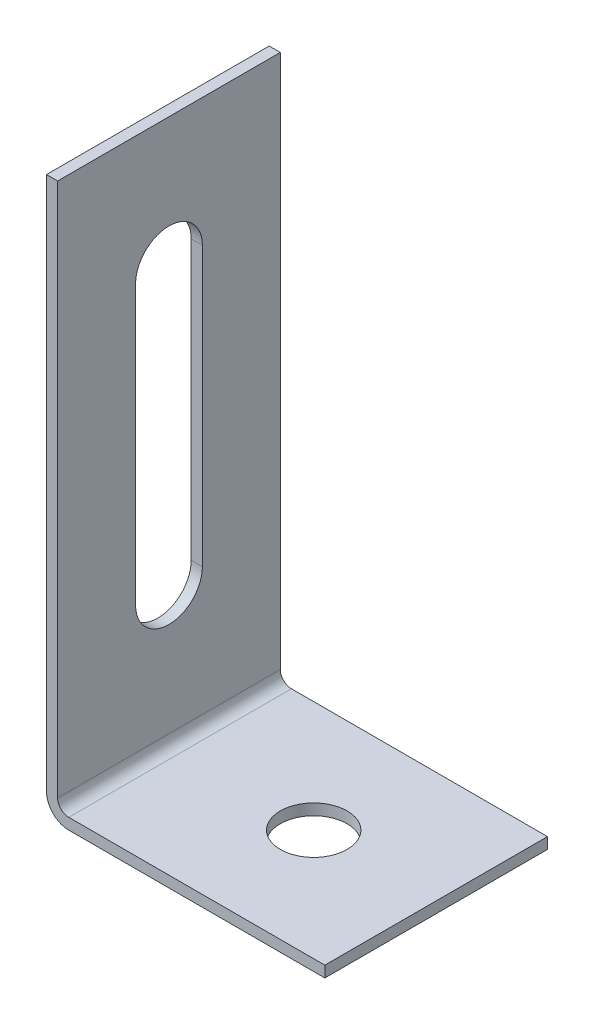
ISO-10303-21;
HEADER;
FILE_DESCRIPTION(('STEP AP214'),'2;1');
FILE_NAME('part.step','',(''),(''),'','','');
FILE_SCHEMA(('AUTOMOTIVE_DESIGN { 1 0 10303 214 1 1 1 1 }'));
ENDSEC;
DATA;
#1=APPLICATION_CONTEXT('core data for automotive mechanical design processes');
#2=APPLICATION_PROTOCOL_DEFINITION('international standard','automotive_design',2000,#1);
#3=PRODUCT_CONTEXT('',#1,'mechanical');
#4=PRODUCT('Part','Part','',(#3));
#5=PRODUCT_RELATED_PRODUCT_CATEGORY('part','',(#4));
#6=PRODUCT_DEFINITION_FORMATION('','',#4);
#7=PRODUCT_DEFINITION_CONTEXT('part definition',#1,'design');
#8=PRODUCT_DEFINITION('design','',#6,#7);
#9=PRODUCT_DEFINITION_SHAPE('','',#8);
#10=(LENGTH_UNIT() NAMED_UNIT(*) SI_UNIT(.MILLI.,.METRE.));
#11=(NAMED_UNIT(*) PLANE_ANGLE_UNIT() SI_UNIT($,.RADIAN.));
#12=(NAMED_UNIT(*) SI_UNIT($,.STERADIAN.) SOLID_ANGLE_UNIT());
#13=UNCERTAINTY_MEASURE_WITH_UNIT(LENGTH_MEASURE(1.E-05),#10,'distance_accuracy_value','');
#14=(GEOMETRIC_REPRESENTATION_CONTEXT(3) GLOBAL_UNCERTAINTY_ASSIGNED_CONTEXT((#13)) GLOBAL_UNIT_ASSIGNED_CONTEXT((#10,
#11,#12)) REPRESENTATION_CONTEXT('',''));
#15=CARTESIAN_POINT('',(0.,0.,0.));
#16=DIRECTION('',(0.,0.,1.));
#17=DIRECTION('',(1.,0.,0.));
#18=AXIS2_PLACEMENT_3D('',#15,#16,#17);
#19=CARTESIAN_POINT('',(0.,50.,20.));
#20=DIRECTION('',(0.,-1.,0.));
#21=DIRECTION('',(0.,0.,-1.));
#22=AXIS2_PLACEMENT_3D('',#19,#20,#21);
#23=PLANE('',#22);
#24=DIRECTION('',(-1.,0.,0.));
#25=VECTOR('',#24,1.);
#26=CARTESIAN_POINT('',(0.,50.,0.));
#27=LINE('',#26,#25);
#28=CARTESIAN_POINT('',(1.00000000000001,50.,0.));
#29=VERTEX_POINT('',#28);
#30=CARTESIAN_POINT('',(0.,50.,0.));
#31=VERTEX_POINT('',#30);
#32=EDGE_CURVE('E166',#29,#31,#27,.T.);
#33=ORIENTED_EDGE('',*,*,#32,.T.);
#34=DIRECTION('',(0.,0.,-1.));
#35=VECTOR('',#34,1.);
#36=CARTESIAN_POINT('',(0.,50.,20.));
#37=LINE('',#36,#35);
#38=CARTESIAN_POINT('',(0.,50.,20.));
#39=VERTEX_POINT('',#38);
#40=EDGE_CURVE('E11',#39,#31,#37,.T.);
#41=ORIENTED_EDGE('',*,*,#40,.F.);
#42=DIRECTION('',(-1.,0.,0.));
#43=VECTOR('',#42,1.);
#44=CARTESIAN_POINT('',(0.,50.,20.));
#45=LINE('',#44,#43);
#46=CARTESIAN_POINT('',(1.00000000000001,50.,20.));
#47=VERTEX_POINT('',#46);
#48=EDGE_CURVE('E167',#47,#39,#45,.T.);
#49=ORIENTED_EDGE('',*,*,#48,.F.);
#50=DIRECTION('',(0.,0.,-1.));
#51=VECTOR('',#50,1.);
#52=CARTESIAN_POINT('',(1.00000000000001,50.,20.));
#53=LINE('',#52,#51);
#54=EDGE_CURVE('E185',#47,#29,#53,.T.);
#55=ORIENTED_EDGE('',*,*,#54,.T.);
#56=EDGE_LOOP('',(#33,#41,#49,#55));
#57=FACE_BOUND('',#56,.T.);
#58=ADVANCED_FACE('F41',(#57),#23,.F.);
#59=CARTESIAN_POINT('',(0.,2.00000000000001,20.));
#60=DIRECTION('',(1.,0.,0.));
#61=DIRECTION('',(0.,1.,0.));
#62=AXIS2_PLACEMENT_3D('',#59,#60,#61);
#63=PLANE('',#62);
#64=DIRECTION('',(0.,-1.,0.));
#65=VECTOR('',#64,1.);
#66=CARTESIAN_POINT('',(0.,2.00000000000002,13.));
#67=LINE('',#66,#65);
#68=CARTESIAN_POINT('',(0.,38.5,13.));
#69=VERTEX_POINT('',#68);
#70=CARTESIAN_POINT('',(0.,13.5,13.));
#71=VERTEX_POINT('',#70);
#72=EDGE_CURVE('E160',#69,#71,#67,.T.);
#73=ORIENTED_EDGE('',*,*,#72,.T.);
#74=CARTESIAN_POINT('',(0.,13.5,9.99999999999999));
#75=DIRECTION('',(1.,0.,0.));
#76=DIRECTION('',(0.,1.,0.));
#77=AXIS2_PLACEMENT_3D('',#74,#75,#76);
#78=CIRCLE('',#77,3.);
#79=CARTESIAN_POINT('',(0.,13.5,6.99999999999999));
#80=VERTEX_POINT('',#79);
#81=EDGE_CURVE('E163',#71,#80,#78,.T.);
#82=ORIENTED_EDGE('',*,*,#81,.T.);
#83=DIRECTION('',(0.,1.,0.));
#84=VECTOR('',#83,1.);
#85=CARTESIAN_POINT('',(0.,2.00000000000002,6.99999999999999));
#86=LINE('',#85,#84);
#87=CARTESIAN_POINT('',(0.,38.5,7.));
#88=VERTEX_POINT('',#87);
#89=EDGE_CURVE('E155',#80,#88,#86,.T.);
#90=ORIENTED_EDGE('',*,*,#89,.T.);
#91=CARTESIAN_POINT('',(0.,38.5,10.));
#92=DIRECTION('',(1.,0.,0.));
#93=DIRECTION('',(0.,1.,0.));
#94=AXIS2_PLACEMENT_3D('',#91,#92,#93);
#95=CIRCLE('',#94,3.);
#96=EDGE_CURVE('E135',#88,#69,#95,.T.);
#97=ORIENTED_EDGE('',*,*,#96,.T.);
#98=EDGE_LOOP('',(#73,#82,#90,#97));
#99=FACE_BOUND('',#98,.T.);
#100=DIRECTION('',(0.,-1.,0.));
#101=VECTOR('',#100,1.);
#102=CARTESIAN_POINT('',(0.,2.00000000000001,0.));
#103=LINE('',#102,#101);
#104=CARTESIAN_POINT('',(0.,2.00000000000001,0.));
#105=VERTEX_POINT('',#104);
#106=EDGE_CURVE('E188',#31,#105,#103,.T.);
#107=ORIENTED_EDGE('',*,*,#106,.T.);
#108=DIRECTION('',(0.,0.,-1.));
#109=VECTOR('',#108,1.);
#110=CARTESIAN_POINT('',(0.,2.00000000000001,20.));
#111=LINE('',#110,#109);
#112=CARTESIAN_POINT('',(0.,2.00000000000001,20.));
#113=VERTEX_POINT('',#112);
#114=EDGE_CURVE('E48',#113,#105,#111,.T.);
#115=ORIENTED_EDGE('',*,*,#114,.F.);
#116=DIRECTION('',(0.,-1.,0.));
#117=VECTOR('',#116,1.);
#118=CARTESIAN_POINT('',(0.,2.00000000000001,20.));
#119=LINE('',#118,#117);
#120=EDGE_CURVE('E170',#39,#113,#119,.T.);
#121=ORIENTED_EDGE('',*,*,#120,.F.);
#122=ORIENTED_EDGE('',*,*,#40,.T.);
#123=EDGE_LOOP('',(#107,#115,#121,#122));
#124=FACE_BOUND('',#123,.T.);
#125=ADVANCED_FACE('F245',(#99,#124),#63,.F.);
#126=CARTESIAN_POINT('',(2.,2.,20.));
#127=DIRECTION('',(0.,0.,-1.));
#128=DIRECTION('',(-1.,0.,0.));
#129=AXIS2_PLACEMENT_3D('',#126,#127,#128);
#130=CYLINDRICAL_SURFACE('',#129,2.);
#131=CARTESIAN_POINT('',(2.,2.,0.));
#132=DIRECTION('',(0.,0.,1.));
#133=DIRECTION('',(1.,0.,0.));
#134=AXIS2_PLACEMENT_3D('',#131,#132,#133);
#135=CIRCLE('',#134,2.);
#136=CARTESIAN_POINT('',(2.00000000000001,0.,0.));
#137=VERTEX_POINT('',#136);
#138=EDGE_CURVE('E190',#105,#137,#135,.T.);
#139=ORIENTED_EDGE('',*,*,#138,.T.);
#140=DIRECTION('',(0.,0.,-1.));
#141=VECTOR('',#140,1.);
#142=CARTESIAN_POINT('',(2.00000000000001,0.,20.));
#143=LINE('',#142,#141);
#144=CARTESIAN_POINT('',(2.00000000000001,0.,20.));
#145=VERTEX_POINT('',#144);
#146=EDGE_CURVE('E215',#145,#137,#143,.T.);
#147=ORIENTED_EDGE('',*,*,#146,.F.);
#148=CARTESIAN_POINT('',(2.,2.,20.));
#149=DIRECTION('',(0.,0.,1.));
#150=DIRECTION('',(1.,0.,0.));
#151=AXIS2_PLACEMENT_3D('',#148,#149,#150);
#152=CIRCLE('',#151,2.);
#153=EDGE_CURVE('E173',#113,#145,#152,.T.);
#154=ORIENTED_EDGE('',*,*,#153,.F.);
#155=ORIENTED_EDGE('',*,*,#114,.T.);
#156=EDGE_LOOP('',(#139,#147,#154,#155));
#157=FACE_BOUND('',#156,.T.);
#158=ADVANCED_FACE('F222',(#157),#130,.T.);
#159=CARTESIAN_POINT('',(2.00000000000001,0.,20.));
#160=DIRECTION('',(0.,1.,0.));
#161=DIRECTION('',(-1.,0.,0.));
#162=AXIS2_PLACEMENT_3D('',#159,#160,#161);
#163=PLANE('',#162);
#164=CARTESIAN_POINT('',(14.,0.,10.));
#165=DIRECTION('',(0.,1.,0.));
#166=DIRECTION('',(-1.,0.,0.));
#167=AXIS2_PLACEMENT_3D('',#164,#165,#166);
#168=CIRCLE('',#167,3.);
#169=CARTESIAN_POINT('',(11.,0.,10.));
#170=VERTEX_POINT('',#169);
#171=EDGE_CURVE('E287',#170,#170,#168,.T.);
#172=ORIENTED_EDGE('',*,*,#171,.T.);
#173=EDGE_LOOP('',(#172));
#174=FACE_BOUND('',#173,.T.);
#175=DIRECTION('',(1.,0.,0.));
#176=VECTOR('',#175,1.);
#177=CARTESIAN_POINT('',(2.00000000000001,0.,0.));
#178=LINE('',#177,#176);
#179=CARTESIAN_POINT('',(25.,0.,0.));
#180=VERTEX_POINT('',#179);
#181=EDGE_CURVE('E192',#137,#180,#178,.T.);
#182=ORIENTED_EDGE('',*,*,#181,.T.);
#183=DIRECTION('',(0.,0.,-1.));
#184=VECTOR('',#183,1.);
#185=CARTESIAN_POINT('',(25.,0.,20.));
#186=LINE('',#185,#184);
#187=CARTESIAN_POINT('',(25.,0.,20.));
#188=VERTEX_POINT('',#187);
#189=EDGE_CURVE('E212',#188,#180,#186,.T.);
#190=ORIENTED_EDGE('',*,*,#189,.F.);
#191=DIRECTION('',(1.,0.,0.));
#192=VECTOR('',#191,1.);
#193=CARTESIAN_POINT('',(2.00000000000001,0.,20.));
#194=LINE('',#193,#192);
#195=EDGE_CURVE('E175',#145,#188,#194,.T.);
#196=ORIENTED_EDGE('',*,*,#195,.F.);
#197=ORIENTED_EDGE('',*,*,#146,.T.);
#198=EDGE_LOOP('',(#182,#190,#196,#197));
#199=FACE_BOUND('',#198,.T.);
#200=ADVANCED_FACE('F233',(#174,#199),#163,.F.);
#201=CARTESIAN_POINT('',(25.,1.00000000000001,20.));
#202=DIRECTION('',(-1.,0.,0.));
#203=DIRECTION('',(0.,0.,1.));
#204=AXIS2_PLACEMENT_3D('',#201,#202,#203);
#205=PLANE('',#204);
#206=DIRECTION('',(0.,1.,0.));
#207=VECTOR('',#206,1.);
#208=CARTESIAN_POINT('',(25.,1.00000000000001,0.));
#209=LINE('',#208,#207);
#210=CARTESIAN_POINT('',(25.,1.00000000000001,0.));
#211=VERTEX_POINT('',#210);
#212=EDGE_CURVE('E194',#180,#211,#209,.T.);
#213=ORIENTED_EDGE('',*,*,#212,.T.);
#214=DIRECTION('',(0.,0.,-1.));
#215=VECTOR('',#214,1.);
#216=CARTESIAN_POINT('',(25.,1.00000000000001,20.));
#217=LINE('',#216,#215);
#218=CARTESIAN_POINT('',(25.,1.00000000000001,20.));
#219=VERTEX_POINT('',#218);
#220=EDGE_CURVE('E209',#219,#211,#217,.T.);
#221=ORIENTED_EDGE('',*,*,#220,.F.);
#222=DIRECTION('',(0.,1.,0.));
#223=VECTOR('',#222,1.);
#224=CARTESIAN_POINT('',(25.,1.00000000000001,20.));
#225=LINE('',#224,#223);
#226=EDGE_CURVE('E177',#188,#219,#225,.T.);
#227=ORIENTED_EDGE('',*,*,#226,.F.);
#228=ORIENTED_EDGE('',*,*,#189,.T.);
#229=EDGE_LOOP('',(#213,#221,#227,#228));
#230=FACE_BOUND('',#229,.T.);
#231=ADVANCED_FACE('F237',(#230),#205,.F.);
#232=CARTESIAN_POINT('',(2.00000000000002,1.00000000000001,20.));
#233=DIRECTION('',(0.,-1.,0.));
#234=DIRECTION('',(1.,0.,0.));
#235=AXIS2_PLACEMENT_3D('',#232,#233,#234);
#236=PLANE('',#235);
#237=CARTESIAN_POINT('',(14.,1.00000000000001,10.));
#238=DIRECTION('',(0.,1.,0.));
#239=DIRECTION('',(-1.,0.,0.));
#240=AXIS2_PLACEMENT_3D('',#237,#238,#239);
#241=CIRCLE('',#240,3.);
#242=CARTESIAN_POINT('',(11.,1.00000000000001,10.));
#243=VERTEX_POINT('',#242);
#244=EDGE_CURVE('E289',#243,#243,#241,.T.);
#245=ORIENTED_EDGE('',*,*,#244,.F.);
#246=EDGE_LOOP('',(#245));
#247=FACE_BOUND('',#246,.T.);
#248=DIRECTION('',(-1.,0.,0.));
#249=VECTOR('',#248,1.);
#250=CARTESIAN_POINT('',(2.00000000000002,1.00000000000001,0.));
#251=LINE('',#250,#249);
#252=CARTESIAN_POINT('',(2.00000000000002,1.00000000000001,0.));
#253=VERTEX_POINT('',#252);
#254=EDGE_CURVE('E196',#211,#253,#251,.T.);
#255=ORIENTED_EDGE('',*,*,#254,.T.);
#256=DIRECTION('',(0.,0.,-1.));
#257=VECTOR('',#256,1.);
#258=CARTESIAN_POINT('',(2.00000000000002,1.00000000000001,20.));
#259=LINE('',#258,#257);
#260=CARTESIAN_POINT('',(2.00000000000002,1.00000000000001,20.));
#261=VERTEX_POINT('',#260);
#262=EDGE_CURVE('E206',#261,#253,#259,.T.);
#263=ORIENTED_EDGE('',*,*,#262,.F.);
#264=DIRECTION('',(-1.,0.,0.));
#265=VECTOR('',#264,1.);
#266=CARTESIAN_POINT('',(2.00000000000002,1.00000000000001,20.));
#267=LINE('',#266,#265);
#268=EDGE_CURVE('E179',#219,#261,#267,.T.);
#269=ORIENTED_EDGE('',*,*,#268,.F.);
#270=ORIENTED_EDGE('',*,*,#220,.T.);
#271=EDGE_LOOP('',(#255,#263,#269,#270));
#272=FACE_BOUND('',#271,.T.);
#273=ADVANCED_FACE('F256',(#247,#272),#236,.F.);
#274=CARTESIAN_POINT('',(2.00000000000001,2.00000000000001,20.));
#275=DIRECTION('',(0.,0.,-1.));
#276=DIRECTION('',(-1.,0.,0.));
#277=AXIS2_PLACEMENT_3D('',#274,#275,#276);
#278=CYLINDRICAL_SURFACE('',#277,1.);
#279=CARTESIAN_POINT('',(2.00000000000001,2.00000000000001,0.));
#280=DIRECTION('',(0.,0.,-1.));
#281=DIRECTION('',(-1.,0.,0.));
#282=AXIS2_PLACEMENT_3D('',#279,#280,#281);
#283=CIRCLE('',#282,1.);
#284=CARTESIAN_POINT('',(1.00000000000001,2.00000000000001,0.));
#285=VERTEX_POINT('',#284);
#286=EDGE_CURVE('E198',#253,#285,#283,.T.);
#287=ORIENTED_EDGE('',*,*,#286,.T.);
#288=DIRECTION('',(0.,0.,-1.));
#289=VECTOR('',#288,1.);
#290=CARTESIAN_POINT('',(1.00000000000001,2.00000000000001,20.));
#291=LINE('',#290,#289);
#292=CARTESIAN_POINT('',(1.00000000000001,2.00000000000001,20.));
#293=VERTEX_POINT('',#292);
#294=EDGE_CURVE('E203',#293,#285,#291,.T.);
#295=ORIENTED_EDGE('',*,*,#294,.F.);
#296=CARTESIAN_POINT('',(2.00000000000001,2.00000000000001,20.));
#297=DIRECTION('',(0.,0.,-1.));
#298=DIRECTION('',(-1.,0.,0.));
#299=AXIS2_PLACEMENT_3D('',#296,#297,#298);
#300=CIRCLE('',#299,1.);
#301=EDGE_CURVE('E181',#261,#293,#300,.T.);
#302=ORIENTED_EDGE('',*,*,#301,.F.);
#303=ORIENTED_EDGE('',*,*,#262,.T.);
#304=EDGE_LOOP('',(#287,#295,#302,#303));
#305=FACE_BOUND('',#304,.T.);
#306=ADVANCED_FACE('F254',(#305),#278,.F.);
#307=CARTESIAN_POINT('',(1.00000000000001,2.00000000000002,20.));
#308=DIRECTION('',(-1.,0.,0.));
#309=DIRECTION('',(0.,-1.,0.));
#310=AXIS2_PLACEMENT_3D('',#307,#308,#309);
#311=PLANE('',#310);
#312=DIRECTION('',(0.,1.,0.));
#313=VECTOR('',#312,1.);
#314=CARTESIAN_POINT('',(1.00000000000001,13.5,6.99999999999999));
#315=LINE('',#314,#313);
#316=CARTESIAN_POINT('',(1.00000000000001,13.5,6.99999999999999));
#317=VERTEX_POINT('',#316);
#318=CARTESIAN_POINT('',(1.,38.5,7.));
#319=VERTEX_POINT('',#318);
#320=EDGE_CURVE('E141',#317,#319,#315,.T.);
#321=ORIENTED_EDGE('',*,*,#320,.F.);
#322=CARTESIAN_POINT('',(1.00000000000001,13.5,9.99999999999999));
#323=DIRECTION('',(1.,0.,0.));
#324=DIRECTION('',(0.,1.,0.));
#325=AXIS2_PLACEMENT_3D('',#322,#323,#324);
#326=CIRCLE('',#325,3.);
#327=CARTESIAN_POINT('',(1.00000000000001,13.5,13.));
#328=VERTEX_POINT('',#327);
#329=EDGE_CURVE('E63',#328,#317,#326,.T.);
#330=ORIENTED_EDGE('',*,*,#329,.F.);
#331=DIRECTION('',(0.,-1.,0.));
#332=VECTOR('',#331,1.);
#333=CARTESIAN_POINT('',(1.00000000000001,13.5,13.));
#334=LINE('',#333,#332);
#335=CARTESIAN_POINT('',(1.,38.5,13.));
#336=VERTEX_POINT('',#335);
#337=EDGE_CURVE('E148',#336,#328,#334,.T.);
#338=ORIENTED_EDGE('',*,*,#337,.F.);
#339=CARTESIAN_POINT('',(1.,38.5,10.));
#340=DIRECTION('',(1.,0.,0.));
#341=DIRECTION('',(0.,1.,0.));
#342=AXIS2_PLACEMENT_3D('',#339,#340,#341);
#343=CIRCLE('',#342,3.);
#344=EDGE_CURVE('E132',#319,#336,#343,.T.);
#345=ORIENTED_EDGE('',*,*,#344,.F.);
#346=EDGE_LOOP('',(#321,#330,#338,#345));
#347=FACE_BOUND('',#346,.T.);
#348=DIRECTION('',(0.,1.,0.));
#349=VECTOR('',#348,1.);
#350=CARTESIAN_POINT('',(1.00000000000001,2.00000000000002,0.));
#351=LINE('',#350,#349);
#352=EDGE_CURVE('E171',#285,#29,#351,.T.);
#353=ORIENTED_EDGE('',*,*,#352,.T.);
#354=ORIENTED_EDGE('',*,*,#54,.F.);
#355=DIRECTION('',(0.,1.,0.));
#356=VECTOR('',#355,1.);
#357=CARTESIAN_POINT('',(1.00000000000001,2.00000000000002,20.));
#358=LINE('',#357,#356);
#359=EDGE_CURVE('E183',#293,#47,#358,.T.);
#360=ORIENTED_EDGE('',*,*,#359,.F.);
#361=ORIENTED_EDGE('',*,*,#294,.T.);
#362=EDGE_LOOP('',(#353,#354,#360,#361));
#363=FACE_BOUND('',#362,.T.);
#364=ADVANCED_FACE('F145',(#347,#363),#311,.F.);
#365=CARTESIAN_POINT('',(2.00000000000001,2.00000000000001,20.));
#366=DIRECTION('',(0.,0.,-1.));
#367=DIRECTION('',(-1.,0.,0.));
#368=AXIS2_PLACEMENT_3D('',#365,#366,#367);
#369=PLANE('',#368);
#370=ORIENTED_EDGE('',*,*,#48,.T.);
#371=ORIENTED_EDGE('',*,*,#120,.T.);
#372=ORIENTED_EDGE('',*,*,#153,.T.);
#373=ORIENTED_EDGE('',*,*,#195,.T.);
#374=ORIENTED_EDGE('',*,*,#226,.T.);
#375=ORIENTED_EDGE('',*,*,#268,.T.);
#376=ORIENTED_EDGE('',*,*,#301,.T.);
#377=ORIENTED_EDGE('',*,*,#359,.T.);
#378=EDGE_LOOP('',(#370,#371,#372,#373,#374,#375,#376,#377));
#379=FACE_BOUND('',#378,.T.);
#380=ADVANCED_FACE('F241',(#379),#369,.F.);
#381=CARTESIAN_POINT('',(2.00000000000001,2.00000000000001,0.));
#382=DIRECTION('',(0.,0.,-1.));
#383=DIRECTION('',(-1.,0.,0.));
#384=AXIS2_PLACEMENT_3D('',#381,#382,#383);
#385=PLANE('',#384);
#386=ORIENTED_EDGE('',*,*,#32,.F.);
#387=ORIENTED_EDGE('',*,*,#352,.F.);
#388=ORIENTED_EDGE('',*,*,#286,.F.);
#389=ORIENTED_EDGE('',*,*,#254,.F.);
#390=ORIENTED_EDGE('',*,*,#212,.F.);
#391=ORIENTED_EDGE('',*,*,#181,.F.);
#392=ORIENTED_EDGE('',*,*,#138,.F.);
#393=ORIENTED_EDGE('',*,*,#106,.F.);
#394=EDGE_LOOP('',(#386,#387,#388,#389,#390,#391,#392,#393));
#395=FACE_BOUND('',#394,.T.);
#396=ADVANCED_FACE('F228',(#395),#385,.T.);
#397=CARTESIAN_POINT('',(-8.99999999999999,13.5,9.99999999999999));
#398=DIRECTION('',(1.,0.,0.));
#399=DIRECTION('',(0.,1.,0.));
#400=AXIS2_PLACEMENT_3D('',#397,#398,#399);
#401=CYLINDRICAL_SURFACE('',#400,3.);
#402=DIRECTION('',(1.,0.,0.));
#403=VECTOR('',#402,1.);
#404=CARTESIAN_POINT('',(-8.99999999999999,13.5,13.));
#405=LINE('',#404,#403);
#406=EDGE_CURVE('E153',#71,#328,#405,.T.);
#407=ORIENTED_EDGE('',*,*,#406,.T.);
#408=ORIENTED_EDGE('',*,*,#329,.T.);
#409=DIRECTION('',(1.,0.,0.));
#410=VECTOR('',#409,1.);
#411=CARTESIAN_POINT('',(-8.99999999999999,13.5,6.99999999999999));
#412=LINE('',#411,#410);
#413=EDGE_CURVE('E138',#80,#317,#412,.T.);
#414=ORIENTED_EDGE('',*,*,#413,.F.);
#415=ORIENTED_EDGE('',*,*,#81,.F.);
#416=EDGE_LOOP('',(#407,#408,#414,#415));
#417=FACE_BOUND('',#416,.T.);
#418=ADVANCED_FACE('F303',(#417),#401,.F.);
#419=CARTESIAN_POINT('',(-8.99999999999999,13.5,13.));
#420=DIRECTION('',(0.,0.,1.));
#421=DIRECTION('',(0.,-1.,0.));
#422=AXIS2_PLACEMENT_3D('',#419,#420,#421);
#423=PLANE('',#422);
#424=DIRECTION('',(1.,0.,0.));
#425=VECTOR('',#424,1.);
#426=CARTESIAN_POINT('',(-9.,38.5,13.));
#427=LINE('',#426,#425);
#428=EDGE_CURVE('E137',#69,#336,#427,.T.);
#429=ORIENTED_EDGE('',*,*,#428,.T.);
#430=ORIENTED_EDGE('',*,*,#337,.T.);
#431=ORIENTED_EDGE('',*,*,#406,.F.);
#432=ORIENTED_EDGE('',*,*,#72,.F.);
#433=EDGE_LOOP('',(#429,#430,#431,#432));
#434=FACE_BOUND('',#433,.T.);
#435=ADVANCED_FACE('F300',(#434),#423,.F.);
#436=CARTESIAN_POINT('',(-9.,38.5,10.));
#437=DIRECTION('',(1.,0.,0.));
#438=DIRECTION('',(0.,1.,0.));
#439=AXIS2_PLACEMENT_3D('',#436,#437,#438);
#440=CYLINDRICAL_SURFACE('',#439,3.);
#441=DIRECTION('',(1.,0.,0.));
#442=VECTOR('',#441,1.);
#443=CARTESIAN_POINT('',(-9.,38.5,7.));
#444=LINE('',#443,#442);
#445=EDGE_CURVE('E55',#88,#319,#444,.T.);
#446=ORIENTED_EDGE('',*,*,#445,.T.);
#447=ORIENTED_EDGE('',*,*,#344,.T.);
#448=ORIENTED_EDGE('',*,*,#428,.F.);
#449=ORIENTED_EDGE('',*,*,#96,.F.);
#450=EDGE_LOOP('',(#446,#447,#448,#449));
#451=FACE_BOUND('',#450,.T.);
#452=ADVANCED_FACE('F129',(#451),#440,.F.);
#453=CARTESIAN_POINT('',(-8.99999999999999,13.5,6.99999999999999));
#454=DIRECTION('',(0.,0.,-1.));
#455=DIRECTION('',(0.,1.,0.));
#456=AXIS2_PLACEMENT_3D('',#453,#454,#455);
#457=PLANE('',#456);
#458=ORIENTED_EDGE('',*,*,#413,.T.);
#459=ORIENTED_EDGE('',*,*,#320,.T.);
#460=ORIENTED_EDGE('',*,*,#445,.F.);
#461=ORIENTED_EDGE('',*,*,#89,.F.);
#462=EDGE_LOOP('',(#458,#459,#460,#461));
#463=FACE_BOUND('',#462,.T.);
#464=ADVANCED_FACE('F142',(#463),#457,.F.);
#465=CARTESIAN_POINT('',(14.,-8.99999999999999,10.));
#466=DIRECTION('',(0.,1.,0.));
#467=DIRECTION('',(-1.,0.,0.));
#468=AXIS2_PLACEMENT_3D('',#465,#466,#467);
#469=CYLINDRICAL_SURFACE('',#468,3.);
#470=ORIENTED_EDGE('',*,*,#244,.T.);
#471=EDGE_LOOP('',(#470));
#472=FACE_BOUND('',#471,.T.);
#473=ORIENTED_EDGE('',*,*,#171,.F.);
#474=EDGE_LOOP('',(#473));
#475=FACE_BOUND('',#474,.T.);
#476=ADVANCED_FACE('F294',(#472,#475),#469,.F.);
#477=CLOSED_SHELL('',(#58,#125,#158,#200,#231,#273,#306,#364,#380,#396,#418,#435,#452,#464,#476));
#478=MANIFOLD_SOLID_BREP('B2',#477);
#479=ADVANCED_BREP_SHAPE_REPRESENTATION('',(#18,#478),#14);
#480=SHAPE_DEFINITION_REPRESENTATION(#9,#479);
ENDSEC;
END-ISO-10303-21;
